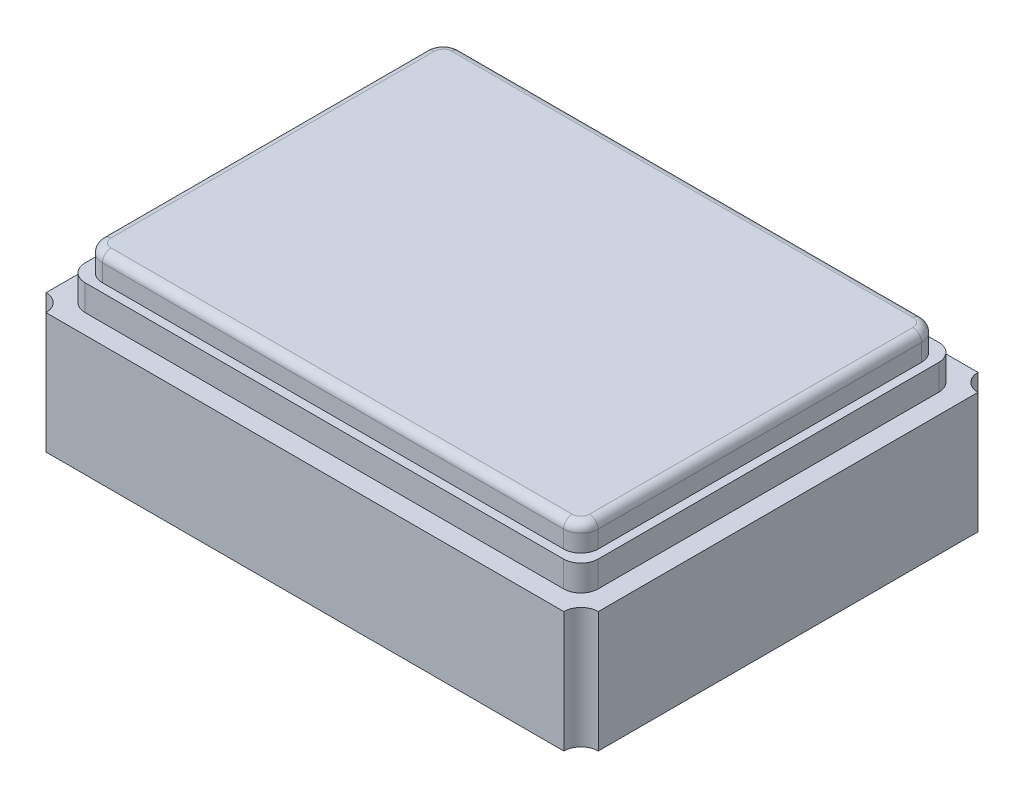
ISO-10303-21;
HEADER;
FILE_DESCRIPTION(('STEP AP214'),'2;1');
FILE_NAME('part.step','',(''),(''),'','','');
FILE_SCHEMA(('AUTOMOTIVE_DESIGN { 1 0 10303 214 1 1 1 1 }'));
ENDSEC;
DATA;
#1=APPLICATION_CONTEXT('core data for automotive mechanical design processes');
#2=APPLICATION_PROTOCOL_DEFINITION('international standard','automotive_design',2000,#1);
#3=PRODUCT_CONTEXT('',#1,'mechanical');
#4=PRODUCT('Part','Part','',(#3));
#5=PRODUCT_RELATED_PRODUCT_CATEGORY('part','',(#4));
#6=PRODUCT_DEFINITION_FORMATION('','',#4);
#7=PRODUCT_DEFINITION_CONTEXT('part definition',#1,'design');
#8=PRODUCT_DEFINITION('design','',#6,#7);
#9=PRODUCT_DEFINITION_SHAPE('','',#8);
#10=(LENGTH_UNIT() NAMED_UNIT(*) SI_UNIT(.MILLI.,.METRE.));
#11=(NAMED_UNIT(*) PLANE_ANGLE_UNIT() SI_UNIT($,.RADIAN.));
#12=(NAMED_UNIT(*) SI_UNIT($,.STERADIAN.) SOLID_ANGLE_UNIT());
#13=UNCERTAINTY_MEASURE_WITH_UNIT(LENGTH_MEASURE(1.E-05),#10,'distance_accuracy_value','');
#14=(GEOMETRIC_REPRESENTATION_CONTEXT(3) GLOBAL_UNCERTAINTY_ASSIGNED_CONTEXT((#13)) GLOBAL_UNIT_ASSIGNED_CONTEXT((#10,
#11,#12)) REPRESENTATION_CONTEXT('',''));
#15=CARTESIAN_POINT('',(0.,0.,0.));
#16=DIRECTION('',(0.,0.,1.));
#17=DIRECTION('',(1.,0.,0.));
#18=AXIS2_PLACEMENT_3D('',#15,#16,#17);
#19=CARTESIAN_POINT('',(-1.33609678096629,1.,0.936846899512658));
#20=DIRECTION('',(0.,-1.,0.));
#21=DIRECTION('',(0.,0.,-1.));
#22=AXIS2_PLACEMENT_3D('',#19,#20,#21);
#23=CYLINDRICAL_SURFACE('',#22,0.0999999999999999);
#24=DIRECTION('',(0.,-1.,0.));
#25=VECTOR('',#24,1.);
#26=CARTESIAN_POINT('',(-1.33609678096629,1.,1.03684689951266));
#27=LINE('',#26,#25);
#28=CARTESIAN_POINT('',(-1.33609678096629,0.95,1.03684689951266));
#29=VERTEX_POINT('',#28);
#30=CARTESIAN_POINT('',(-1.33609678096629,0.85,1.03684689951266));
#31=VERTEX_POINT('',#30);
#32=EDGE_CURVE('E131',#29,#31,#27,.T.);
#33=ORIENTED_EDGE('',*,*,#32,.F.);
#34=CARTESIAN_POINT('',(-1.33609678096629,0.95,0.936846899512658));
#35=DIRECTION('',(0.,-1.,0.));
#36=DIRECTION('',(0.,0.,-1.));
#37=AXIS2_PLACEMENT_3D('',#34,#35,#36);
#38=CIRCLE('',#37,0.0999999999999999);
#39=CARTESIAN_POINT('',(-1.43609678096628,0.95,0.936846899512658));
#40=VERTEX_POINT('',#39);
#41=EDGE_CURVE('E12',#29,#40,#38,.T.);
#42=ORIENTED_EDGE('',*,*,#41,.T.);
#43=DIRECTION('',(0.,-1.,0.));
#44=VECTOR('',#43,1.);
#45=CARTESIAN_POINT('',(-1.43609678096628,1.,0.936846899512658));
#46=LINE('',#45,#44);
#47=CARTESIAN_POINT('',(-1.43609678096628,0.85,0.936846899512658));
#48=VERTEX_POINT('',#47);
#49=EDGE_CURVE('E152',#40,#48,#46,.T.);
#50=ORIENTED_EDGE('',*,*,#49,.T.);
#51=CARTESIAN_POINT('',(-1.33609678096629,0.85,0.936846899512658));
#52=DIRECTION('',(0.,1.,0.));
#53=DIRECTION('',(0.,0.,-1.));
#54=AXIS2_PLACEMENT_3D('',#51,#52,#53);
#55=CIRCLE('',#54,0.0999999999999999);
#56=EDGE_CURVE('E146',#48,#31,#55,.T.);
#57=ORIENTED_EDGE('',*,*,#56,.T.);
#58=EDGE_LOOP('',(#33,#42,#50,#57));
#59=FACE_BOUND('',#58,.T.);
#60=ADVANCED_FACE('F43',(#59),#23,.T.);
#61=CARTESIAN_POINT('',(-1.33609678096629,1.,1.03684689951266));
#62=DIRECTION('',(0.,0.,-1.));
#63=DIRECTION('',(-1.,0.,0.));
#64=AXIS2_PLACEMENT_3D('',#61,#62,#63);
#65=PLANE('',#64);
#66=DIRECTION('',(0.,-1.,0.));
#67=VECTOR('',#66,1.);
#68=CARTESIAN_POINT('',(1.33609678096629,1.,1.03684689951266));
#69=LINE('',#68,#67);
#70=CARTESIAN_POINT('',(1.33609678096629,0.95,1.03684689951266));
#71=VERTEX_POINT('',#70);
#72=CARTESIAN_POINT('',(1.33609678096629,0.85,1.03684689951266));
#73=VERTEX_POINT('',#72);
#74=EDGE_CURVE('E140',#71,#73,#69,.T.);
#75=ORIENTED_EDGE('',*,*,#74,.F.);
#76=DIRECTION('',(1.,0.,0.));
#77=VECTOR('',#76,1.);
#78=CARTESIAN_POINT('',(-1.33609678096629,0.95,1.03684689951266));
#79=LINE('',#78,#77);
#80=EDGE_CURVE('E52',#71,#29,#79,.F.);
#81=ORIENTED_EDGE('',*,*,#80,.T.);
#82=ORIENTED_EDGE('',*,*,#32,.T.);
#83=DIRECTION('',(1.,0.,0.));
#84=VECTOR('',#83,1.);
#85=CARTESIAN_POINT('',(-1.33609678096629,0.85,1.03684689951266));
#86=LINE('',#85,#84);
#87=EDGE_CURVE('E134',#31,#73,#86,.T.);
#88=ORIENTED_EDGE('',*,*,#87,.T.);
#89=EDGE_LOOP('',(#75,#81,#82,#88));
#90=FACE_BOUND('',#89,.T.);
#91=ADVANCED_FACE('F133',(#90),#65,.F.);
#92=CARTESIAN_POINT('',(1.33609678096629,1.,0.936846899512658));
#93=DIRECTION('',(0.,-1.,0.));
#94=DIRECTION('',(0.,0.,-1.));
#95=AXIS2_PLACEMENT_3D('',#92,#93,#94);
#96=CYLINDRICAL_SURFACE('',#95,0.1);
#97=DIRECTION('',(0.,-1.,0.));
#98=VECTOR('',#97,1.);
#99=CARTESIAN_POINT('',(1.43609678096629,1.,0.936846899512658));
#100=LINE('',#99,#98);
#101=CARTESIAN_POINT('',(1.43609678096629,0.95,0.936846899512658));
#102=VERTEX_POINT('',#101);
#103=CARTESIAN_POINT('',(1.43609678096629,0.85,0.936846899512658));
#104=VERTEX_POINT('',#103);
#105=EDGE_CURVE('E182',#102,#104,#100,.T.);
#106=ORIENTED_EDGE('',*,*,#105,.F.);
#107=CARTESIAN_POINT('',(1.33609678096629,0.95,0.936846899512658));
#108=DIRECTION('',(0.,-1.,0.));
#109=DIRECTION('',(0.,0.,-1.));
#110=AXIS2_PLACEMENT_3D('',#107,#108,#109);
#111=CIRCLE('',#110,0.1);
#112=EDGE_CURVE('E67',#102,#71,#111,.T.);
#113=ORIENTED_EDGE('',*,*,#112,.T.);
#114=ORIENTED_EDGE('',*,*,#74,.T.);
#115=CARTESIAN_POINT('',(1.33609678096629,0.85,0.936846899512658));
#116=DIRECTION('',(0.,1.,0.));
#117=DIRECTION('',(0.,0.,1.));
#118=AXIS2_PLACEMENT_3D('',#115,#116,#117);
#119=CIRCLE('',#118,0.1);
#120=EDGE_CURVE('E149',#73,#104,#119,.T.);
#121=ORIENTED_EDGE('',*,*,#120,.T.);
#122=EDGE_LOOP('',(#106,#113,#114,#121));
#123=FACE_BOUND('',#122,.T.);
#124=ADVANCED_FACE('F285',(#123),#96,.T.);
#125=CARTESIAN_POINT('',(1.43609678096629,1.,0.936846899512658));
#126=DIRECTION('',(-1.,0.,0.));
#127=DIRECTION('',(0.,0.,1.));
#128=AXIS2_PLACEMENT_3D('',#125,#126,#127);
#129=PLANE('',#128);
#130=DIRECTION('',(0.,-1.,0.));
#131=VECTOR('',#130,1.);
#132=CARTESIAN_POINT('',(1.43609678096629,1.,-0.936846899512658));
#133=LINE('',#132,#131);
#134=CARTESIAN_POINT('',(1.43609678096629,0.95,-0.936846899512658));
#135=VERTEX_POINT('',#134);
#136=CARTESIAN_POINT('',(1.43609678096629,0.85,-0.936846899512658));
#137=VERTEX_POINT('',#136);
#138=EDGE_CURVE('E180',#135,#137,#133,.T.);
#139=ORIENTED_EDGE('',*,*,#138,.F.);
#140=DIRECTION('',(0.,0.,-1.));
#141=VECTOR('',#140,1.);
#142=CARTESIAN_POINT('',(1.43609678096629,0.95,0.936846899512658));
#143=LINE('',#142,#141);
#144=EDGE_CURVE('E210',#135,#102,#143,.F.);
#145=ORIENTED_EDGE('',*,*,#144,.T.);
#146=ORIENTED_EDGE('',*,*,#105,.T.);
#147=DIRECTION('',(0.,0.,-1.));
#148=VECTOR('',#147,1.);
#149=CARTESIAN_POINT('',(1.43609678096629,0.85,0.936846899512658));
#150=LINE('',#149,#148);
#151=EDGE_CURVE('E159',#104,#137,#150,.T.);
#152=ORIENTED_EDGE('',*,*,#151,.T.);
#153=EDGE_LOOP('',(#139,#145,#146,#152));
#154=FACE_BOUND('',#153,.T.);
#155=ADVANCED_FACE('F283',(#154),#129,.F.);
#156=CARTESIAN_POINT('',(1.33609678096629,1.,-0.936846899512658));
#157=DIRECTION('',(0.,-1.,0.));
#158=DIRECTION('',(0.,0.,-1.));
#159=AXIS2_PLACEMENT_3D('',#156,#157,#158);
#160=CYLINDRICAL_SURFACE('',#159,0.1);
#161=DIRECTION('',(0.,-1.,0.));
#162=VECTOR('',#161,1.);
#163=CARTESIAN_POINT('',(1.33609678096629,1.,-1.03684689951266));
#164=LINE('',#163,#162);
#165=CARTESIAN_POINT('',(1.33609678096629,0.95,-1.03684689951266));
#166=VERTEX_POINT('',#165);
#167=CARTESIAN_POINT('',(1.33609678096629,0.85,-1.03684689951266));
#168=VERTEX_POINT('',#167);
#169=EDGE_CURVE('E178',#166,#168,#164,.T.);
#170=ORIENTED_EDGE('',*,*,#169,.F.);
#171=CARTESIAN_POINT('',(1.33609678096629,0.95,-0.936846899512658));
#172=DIRECTION('',(0.,-1.,0.));
#173=DIRECTION('',(0.,0.,-1.));
#174=AXIS2_PLACEMENT_3D('',#171,#172,#173);
#175=CIRCLE('',#174,0.1);
#176=EDGE_CURVE('E208',#166,#135,#175,.T.);
#177=ORIENTED_EDGE('',*,*,#176,.T.);
#178=ORIENTED_EDGE('',*,*,#138,.T.);
#179=CARTESIAN_POINT('',(1.33609678096629,0.85,-0.936846899512658));
#180=DIRECTION('',(0.,1.,0.));
#181=DIRECTION('',(0.,0.,1.));
#182=AXIS2_PLACEMENT_3D('',#179,#180,#181);
#183=CIRCLE('',#182,0.1);
#184=EDGE_CURVE('E162',#137,#168,#183,.T.);
#185=ORIENTED_EDGE('',*,*,#184,.T.);
#186=EDGE_LOOP('',(#170,#177,#178,#185));
#187=FACE_BOUND('',#186,.T.);
#188=ADVANCED_FACE('F281',(#187),#160,.T.);
#189=CARTESIAN_POINT('',(1.33609678096629,1.,-1.03684689951266));
#190=DIRECTION('',(0.,0.,1.));
#191=DIRECTION('',(1.,0.,0.));
#192=AXIS2_PLACEMENT_3D('',#189,#190,#191);
#193=PLANE('',#192);
#194=DIRECTION('',(0.,-1.,0.));
#195=VECTOR('',#194,1.);
#196=CARTESIAN_POINT('',(-1.33609678096629,1.,-1.03684689951266));
#197=LINE('',#196,#195);
#198=CARTESIAN_POINT('',(-1.33609678096629,0.95,-1.03684689951266));
#199=VERTEX_POINT('',#198);
#200=CARTESIAN_POINT('',(-1.33609678096629,0.85,-1.03684689951266));
#201=VERTEX_POINT('',#200);
#202=EDGE_CURVE('E176',#199,#201,#197,.T.);
#203=ORIENTED_EDGE('',*,*,#202,.F.);
#204=DIRECTION('',(-1.,0.,0.));
#205=VECTOR('',#204,1.);
#206=CARTESIAN_POINT('',(1.33609678096629,0.95,-1.03684689951266));
#207=LINE('',#206,#205);
#208=EDGE_CURVE('E206',#199,#166,#207,.F.);
#209=ORIENTED_EDGE('',*,*,#208,.T.);
#210=ORIENTED_EDGE('',*,*,#169,.T.);
#211=DIRECTION('',(-1.,0.,0.));
#212=VECTOR('',#211,1.);
#213=CARTESIAN_POINT('',(1.33609678096629,0.85,-1.03684689951266));
#214=LINE('',#213,#212);
#215=EDGE_CURVE('E165',#168,#201,#214,.T.);
#216=ORIENTED_EDGE('',*,*,#215,.T.);
#217=EDGE_LOOP('',(#203,#209,#210,#216));
#218=FACE_BOUND('',#217,.T.);
#219=ADVANCED_FACE('F269',(#218),#193,.F.);
#220=CARTESIAN_POINT('',(-1.33609678096629,1.,-0.936846899512658));
#221=DIRECTION('',(0.,-1.,0.));
#222=DIRECTION('',(0.,0.,-1.));
#223=AXIS2_PLACEMENT_3D('',#220,#221,#222);
#224=CYLINDRICAL_SURFACE('',#223,0.1);
#225=DIRECTION('',(0.,-1.,0.));
#226=VECTOR('',#225,1.);
#227=CARTESIAN_POINT('',(-1.43609678096629,1.,-0.936846899512658));
#228=LINE('',#227,#226);
#229=CARTESIAN_POINT('',(-1.43609678096629,0.95,-0.936846899512658));
#230=VERTEX_POINT('',#229);
#231=CARTESIAN_POINT('',(-1.43609678096629,0.85,-0.936846899512658));
#232=VERTEX_POINT('',#231);
#233=EDGE_CURVE('E174',#230,#232,#228,.T.);
#234=ORIENTED_EDGE('',*,*,#233,.F.);
#235=CARTESIAN_POINT('',(-1.33609678096629,0.95,-0.936846899512658));
#236=DIRECTION('',(0.,-1.,0.));
#237=DIRECTION('',(0.,0.,-1.));
#238=AXIS2_PLACEMENT_3D('',#235,#236,#237);
#239=CIRCLE('',#238,0.1);
#240=EDGE_CURVE('E204',#230,#199,#239,.T.);
#241=ORIENTED_EDGE('',*,*,#240,.T.);
#242=ORIENTED_EDGE('',*,*,#202,.T.);
#243=CARTESIAN_POINT('',(-1.33609678096629,0.85,-0.936846899512658));
#244=DIRECTION('',(0.,1.,0.));
#245=DIRECTION('',(0.,0.,1.));
#246=AXIS2_PLACEMENT_3D('',#243,#244,#245);
#247=CIRCLE('',#246,0.1);
#248=EDGE_CURVE('E168',#201,#232,#247,.T.);
#249=ORIENTED_EDGE('',*,*,#248,.T.);
#250=EDGE_LOOP('',(#234,#241,#242,#249));
#251=FACE_BOUND('',#250,.T.);
#252=ADVANCED_FACE('F266',(#251),#224,.T.);
#253=CARTESIAN_POINT('',(-1.43609678096629,1.,-0.936846899512658));
#254=DIRECTION('',(1.,0.,0.));
#255=DIRECTION('',(0.,0.,-1.));
#256=AXIS2_PLACEMENT_3D('',#253,#254,#255);
#257=PLANE('',#256);
#258=ORIENTED_EDGE('',*,*,#49,.F.);
#259=DIRECTION('',(0.,0.,1.));
#260=VECTOR('',#259,1.);
#261=CARTESIAN_POINT('',(-1.43609678096629,0.95,-0.936846899512658));
#262=LINE('',#261,#260);
#263=EDGE_CURVE('E201',#40,#230,#262,.F.);
#264=ORIENTED_EDGE('',*,*,#263,.T.);
#265=ORIENTED_EDGE('',*,*,#233,.T.);
#266=DIRECTION('',(0.,0.,1.));
#267=VECTOR('',#266,1.);
#268=CARTESIAN_POINT('',(-1.43609678096629,0.85,-0.936846899512658));
#269=LINE('',#268,#267);
#270=EDGE_CURVE('E171',#232,#48,#269,.T.);
#271=ORIENTED_EDGE('',*,*,#270,.T.);
#272=EDGE_LOOP('',(#258,#264,#265,#271));
#273=FACE_BOUND('',#272,.T.);
#274=ADVANCED_FACE('F253',(#273),#257,.F.);
#275=CARTESIAN_POINT('',(-1.33609678096629,1.,0.936846899512658));
#276=DIRECTION('',(0.,-1.,0.));
#277=DIRECTION('',(0.,0.,-1.));
#278=AXIS2_PLACEMENT_3D('',#275,#276,#277);
#279=PLANE('',#278);
#280=CARTESIAN_POINT('',(-1.33609678096629,1.,-0.936846899512658));
#281=DIRECTION('',(0.,-1.,0.));
#282=DIRECTION('',(0.,0.,-1.));
#283=AXIS2_PLACEMENT_3D('',#280,#281,#282);
#284=CIRCLE('',#283,0.05);
#285=CARTESIAN_POINT('',(-1.33609678096629,1.,-0.986846899512658));
#286=VERTEX_POINT('',#285);
#287=CARTESIAN_POINT('',(-1.38609678096629,1.,-0.936846899512658));
#288=VERTEX_POINT('',#287);
#289=EDGE_CURVE('E196',#286,#288,#284,.F.);
#290=ORIENTED_EDGE('',*,*,#289,.T.);
#291=DIRECTION('',(0.,0.,1.));
#292=VECTOR('',#291,1.);
#293=CARTESIAN_POINT('',(-1.38609678096628,1.,0.936846899512658));
#294=LINE('',#293,#292);
#295=CARTESIAN_POINT('',(-1.38609678096628,1.,0.936846899512658));
#296=VERTEX_POINT('',#295);
#297=EDGE_CURVE('E198',#288,#296,#294,.T.);
#298=ORIENTED_EDGE('',*,*,#297,.T.);
#299=CARTESIAN_POINT('',(-1.33609678096629,1.,0.936846899512658));
#300=DIRECTION('',(0.,-1.,0.));
#301=DIRECTION('',(0.,0.,-1.));
#302=AXIS2_PLACEMENT_3D('',#299,#300,#301);
#303=CIRCLE('',#302,0.0499999999999999);
#304=CARTESIAN_POINT('',(-1.33609678096629,1.,0.986846899512658));
#305=VERTEX_POINT('',#304);
#306=EDGE_CURVE('E139',#296,#305,#303,.F.);
#307=ORIENTED_EDGE('',*,*,#306,.T.);
#308=DIRECTION('',(1.,0.,0.));
#309=VECTOR('',#308,1.);
#310=CARTESIAN_POINT('',(-1.33609678096629,1.,0.986846899512659));
#311=LINE('',#310,#309);
#312=CARTESIAN_POINT('',(1.33609678096629,1.,0.986846899512659));
#313=VERTEX_POINT('',#312);
#314=EDGE_CURVE('E186',#305,#313,#311,.T.);
#315=ORIENTED_EDGE('',*,*,#314,.T.);
#316=CARTESIAN_POINT('',(1.33609678096629,1.,0.936846899512658));
#317=DIRECTION('',(0.,-1.,0.));
#318=DIRECTION('',(0.,0.,-1.));
#319=AXIS2_PLACEMENT_3D('',#316,#317,#318);
#320=CIRCLE('',#319,0.05);
#321=CARTESIAN_POINT('',(1.38609678096629,1.,0.936846899512658));
#322=VERTEX_POINT('',#321);
#323=EDGE_CURVE('E188',#313,#322,#320,.F.);
#324=ORIENTED_EDGE('',*,*,#323,.T.);
#325=DIRECTION('',(0.,0.,-1.));
#326=VECTOR('',#325,1.);
#327=CARTESIAN_POINT('',(1.38609678096629,1.,0.936846899512658));
#328=LINE('',#327,#326);
#329=CARTESIAN_POINT('',(1.38609678096629,1.,-0.936846899512658));
#330=VERTEX_POINT('',#329);
#331=EDGE_CURVE('E190',#322,#330,#328,.T.);
#332=ORIENTED_EDGE('',*,*,#331,.T.);
#333=CARTESIAN_POINT('',(1.33609678096629,1.,-0.936846899512658));
#334=DIRECTION('',(0.,-1.,0.));
#335=DIRECTION('',(0.,0.,-1.));
#336=AXIS2_PLACEMENT_3D('',#333,#334,#335);
#337=CIRCLE('',#336,0.05);
#338=CARTESIAN_POINT('',(1.33609678096629,1.,-0.986846899512659));
#339=VERTEX_POINT('',#338);
#340=EDGE_CURVE('E192',#330,#339,#337,.F.);
#341=ORIENTED_EDGE('',*,*,#340,.T.);
#342=DIRECTION('',(-1.,0.,0.));
#343=VECTOR('',#342,1.);
#344=CARTESIAN_POINT('',(-1.33609678096629,1.,-0.986846899512658));
#345=LINE('',#344,#343);
#346=EDGE_CURVE('E194',#339,#286,#345,.T.);
#347=ORIENTED_EDGE('',*,*,#346,.T.);
#348=EDGE_LOOP('',(#290,#298,#307,#315,#324,#332,#341,#347));
#349=FACE_BOUND('',#348,.T.);
#350=ADVANCED_FACE('F241',(#349),#279,.F.);
#351=CARTESIAN_POINT('',(-1.33609678096629,0.85,0.936846899512658));
#352=DIRECTION('',(0.,-1.,0.));
#353=DIRECTION('',(0.,0.,-1.));
#354=AXIS2_PLACEMENT_3D('',#351,#352,#353);
#355=PLANE('',#354);
#356=ORIENTED_EDGE('',*,*,#56,.F.);
#357=ORIENTED_EDGE('',*,*,#270,.F.);
#358=ORIENTED_EDGE('',*,*,#248,.F.);
#359=ORIENTED_EDGE('',*,*,#215,.F.);
#360=ORIENTED_EDGE('',*,*,#184,.F.);
#361=ORIENTED_EDGE('',*,*,#151,.F.);
#362=ORIENTED_EDGE('',*,*,#120,.F.);
#363=ORIENTED_EDGE('',*,*,#87,.F.);
#364=EDGE_LOOP('',(#356,#357,#358,#359,#360,#361,#362,#363));
#365=FACE_BOUND('',#364,.T.);
#366=ADVANCED_FACE('F144',(#365),#355,.T.);
#367=CARTESIAN_POINT('',(1.38609678096629,0.95,0.936846899512658));
#368=DIRECTION('',(0.,0.,-1.));
#369=DIRECTION('',(-1.,0.,0.));
#370=AXIS2_PLACEMENT_3D('',#367,#368,#369);
#371=CYLINDRICAL_SURFACE('',#370,0.05);
#372=CARTESIAN_POINT('',(1.38609678096629,0.95,0.936846899512658));
#373=DIRECTION('',(0.,0.,1.));
#374=DIRECTION('',(1.,0.,0.));
#375=AXIS2_PLACEMENT_3D('',#372,#373,#374);
#376=CIRCLE('',#375,0.05);
#377=EDGE_CURVE('E156',#102,#322,#376,.T.);
#378=ORIENTED_EDGE('',*,*,#377,.F.);
#379=ORIENTED_EDGE('',*,*,#144,.F.);
#380=CARTESIAN_POINT('',(1.38609678096629,0.95,-0.936846899512658));
#381=DIRECTION('',(0.,0.,-1.));
#382=DIRECTION('',(-1.,0.,0.));
#383=AXIS2_PLACEMENT_3D('',#380,#381,#382);
#384=CIRCLE('',#383,0.05);
#385=EDGE_CURVE('E47',#330,#135,#384,.T.);
#386=ORIENTED_EDGE('',*,*,#385,.F.);
#387=ORIENTED_EDGE('',*,*,#331,.F.);
#388=EDGE_LOOP('',(#378,#379,#386,#387));
#389=FACE_BOUND('',#388,.T.);
#390=ADVANCED_FACE('F45',(#389),#371,.T.);
#391=CARTESIAN_POINT('',(1.33609678096629,0.95,-0.936846899512658));
#392=DIRECTION('',(0.,-1.,0.));
#393=DIRECTION('',(0.,0.,-1.));
#394=AXIS2_PLACEMENT_3D('',#391,#392,#393);
#395=TOROIDAL_SURFACE('',#394,0.05,0.05);
#396=ORIENTED_EDGE('',*,*,#385,.T.);
#397=ORIENTED_EDGE('',*,*,#176,.F.);
#398=CARTESIAN_POINT('',(1.33609678096629,0.95,-0.986846899512659));
#399=DIRECTION('',(-1.,0.,0.));
#400=DIRECTION('',(0.,0.,1.));
#401=AXIS2_PLACEMENT_3D('',#398,#399,#400);
#402=CIRCLE('',#401,0.05);
#403=EDGE_CURVE('E227',#339,#166,#402,.T.);
#404=ORIENTED_EDGE('',*,*,#403,.F.);
#405=ORIENTED_EDGE('',*,*,#340,.F.);
#406=EDGE_LOOP('',(#396,#397,#404,#405));
#407=FACE_BOUND('',#406,.T.);
#408=ADVANCED_FACE('F278',(#407),#395,.T.);
#409=CARTESIAN_POINT('',(1.33609678096629,0.95,0.936846899512658));
#410=DIRECTION('',(0.,-1.,0.));
#411=DIRECTION('',(0.,0.,-1.));
#412=AXIS2_PLACEMENT_3D('',#409,#410,#411);
#413=DEGENERATE_TOROIDAL_SURFACE('',#412,0.05,0.05,.T.);
#414=ORIENTED_EDGE('',*,*,#377,.T.);
#415=ORIENTED_EDGE('',*,*,#323,.F.);
#416=CARTESIAN_POINT('',(1.33609678096629,0.95,0.986846899512658));
#417=DIRECTION('',(-1.,0.,0.));
#418=DIRECTION('',(0.,0.,1.));
#419=AXIS2_PLACEMENT_3D('',#416,#417,#418);
#420=CIRCLE('',#419,0.05);
#421=EDGE_CURVE('E224',#71,#313,#420,.T.);
#422=ORIENTED_EDGE('',*,*,#421,.F.);
#423=ORIENTED_EDGE('',*,*,#112,.F.);
#424=EDGE_LOOP('',(#414,#415,#422,#423));
#425=FACE_BOUND('',#424,.T.);
#426=ADVANCED_FACE('F233',(#425),#413,.T.);
#427=CARTESIAN_POINT('',(-1.33609678096629,0.95,-0.986846899512658));
#428=DIRECTION('',(-1.,0.,0.));
#429=DIRECTION('',(0.,0.,1.));
#430=AXIS2_PLACEMENT_3D('',#427,#428,#429);
#431=CYLINDRICAL_SURFACE('',#430,0.05);
#432=ORIENTED_EDGE('',*,*,#403,.T.);
#433=ORIENTED_EDGE('',*,*,#208,.F.);
#434=CARTESIAN_POINT('',(-1.33609678096629,0.95,-0.986846899512658));
#435=DIRECTION('',(-1.,0.,0.));
#436=DIRECTION('',(0.,0.,1.));
#437=AXIS2_PLACEMENT_3D('',#434,#435,#436);
#438=CIRCLE('',#437,0.05);
#439=EDGE_CURVE('E221',#286,#199,#438,.T.);
#440=ORIENTED_EDGE('',*,*,#439,.F.);
#441=ORIENTED_EDGE('',*,*,#346,.F.);
#442=EDGE_LOOP('',(#432,#433,#440,#441));
#443=FACE_BOUND('',#442,.T.);
#444=ADVANCED_FACE('F274',(#443),#431,.T.);
#445=CARTESIAN_POINT('',(-1.33609678096629,0.95,0.986846899512659));
#446=DIRECTION('',(1.,0.,0.));
#447=DIRECTION('',(0.,0.,-1.));
#448=AXIS2_PLACEMENT_3D('',#445,#446,#447);
#449=CYLINDRICAL_SURFACE('',#448,0.05);
#450=ORIENTED_EDGE('',*,*,#421,.T.);
#451=ORIENTED_EDGE('',*,*,#314,.F.);
#452=CARTESIAN_POINT('',(-1.33609678096629,0.95,0.986846899512659));
#453=DIRECTION('',(-1.,0.,0.));
#454=DIRECTION('',(0.,0.,1.));
#455=AXIS2_PLACEMENT_3D('',#452,#453,#454);
#456=CIRCLE('',#455,0.05);
#457=EDGE_CURVE('E218',#29,#305,#456,.T.);
#458=ORIENTED_EDGE('',*,*,#457,.F.);
#459=ORIENTED_EDGE('',*,*,#80,.F.);
#460=EDGE_LOOP('',(#450,#451,#458,#459));
#461=FACE_BOUND('',#460,.T.);
#462=ADVANCED_FACE('F246',(#461),#449,.T.);
#463=CARTESIAN_POINT('',(-1.33609678096629,0.95,-0.936846899512658));
#464=DIRECTION('',(0.,-1.,0.));
#465=DIRECTION('',(0.,0.,-1.));
#466=AXIS2_PLACEMENT_3D('',#463,#464,#465);
#467=TOROIDAL_SURFACE('',#466,0.05,0.05);
#468=ORIENTED_EDGE('',*,*,#439,.T.);
#469=ORIENTED_EDGE('',*,*,#240,.F.);
#470=CARTESIAN_POINT('',(-1.38609678096629,0.95,-0.936846899512658));
#471=DIRECTION('',(0.,0.,1.));
#472=DIRECTION('',(1.,0.,0.));
#473=AXIS2_PLACEMENT_3D('',#470,#471,#472);
#474=CIRCLE('',#473,0.05);
#475=EDGE_CURVE('E216',#288,#230,#474,.T.);
#476=ORIENTED_EDGE('',*,*,#475,.F.);
#477=ORIENTED_EDGE('',*,*,#289,.F.);
#478=EDGE_LOOP('',(#468,#469,#476,#477));
#479=FACE_BOUND('',#478,.T.);
#480=ADVANCED_FACE('F262',(#479),#467,.T.);
#481=CARTESIAN_POINT('',(-1.33609678096629,0.95,0.936846899512658));
#482=DIRECTION('',(0.,-1.,0.));
#483=DIRECTION('',(0.,0.,-1.));
#484=AXIS2_PLACEMENT_3D('',#481,#482,#483);
#485=DEGENERATE_TOROIDAL_SURFACE('',#484,0.0499999999999999,0.05,.T.);
#486=ORIENTED_EDGE('',*,*,#457,.T.);
#487=ORIENTED_EDGE('',*,*,#306,.F.);
#488=CARTESIAN_POINT('',(-1.38609678096628,0.95,0.936846899512658));
#489=DIRECTION('',(0.,0.,-1.));
#490=DIRECTION('',(-1.,0.,0.));
#491=AXIS2_PLACEMENT_3D('',#488,#489,#490);
#492=CIRCLE('',#491,0.05);
#493=EDGE_CURVE('E214',#40,#296,#492,.T.);
#494=ORIENTED_EDGE('',*,*,#493,.F.);
#495=ORIENTED_EDGE('',*,*,#41,.F.);
#496=EDGE_LOOP('',(#486,#487,#494,#495));
#497=FACE_BOUND('',#496,.T.);
#498=ADVANCED_FACE('F249',(#497),#485,.T.);
#499=CARTESIAN_POINT('',(-1.38609678096628,0.95,0.936846899512658));
#500=DIRECTION('',(0.,0.,1.));
#501=DIRECTION('',(1.,0.,0.));
#502=AXIS2_PLACEMENT_3D('',#499,#500,#501);
#503=CYLINDRICAL_SURFACE('',#502,0.05);
#504=ORIENTED_EDGE('',*,*,#475,.T.);
#505=ORIENTED_EDGE('',*,*,#263,.F.);
#506=ORIENTED_EDGE('',*,*,#493,.T.);
#507=ORIENTED_EDGE('',*,*,#297,.F.);
#508=EDGE_LOOP('',(#504,#505,#506,#507));
#509=FACE_BOUND('',#508,.T.);
#510=ADVANCED_FACE('F256',(#509),#503,.T.);
#511=CLOSED_SHELL('',(#60,#91,#124,#155,#188,#219,#252,#274,#350,#366,#390,#408,#426,#444,#462,
#480,#498,#510));
#512=MANIFOLD_SOLID_BREP('B2',#511);
#513=CARTESIAN_POINT('',(-1.38609678096629,0.85,0.986846899512658));
#514=DIRECTION('',(0.,-1.,0.));
#515=DIRECTION('',(0.,0.,-1.));
#516=AXIS2_PLACEMENT_3D('',#513,#514,#515);
#517=CYLINDRICAL_SURFACE('',#516,0.1);
#518=CARTESIAN_POINT('',(-1.38609678096629,0.7,0.986846899512658));
#519=DIRECTION('',(0.,1.,0.));
#520=DIRECTION('',(0.,0.,-1.));
#521=AXIS2_PLACEMENT_3D('',#518,#519,#520);
#522=CIRCLE('',#521,0.1);
#523=CARTESIAN_POINT('',(-1.48609678096629,0.7,0.986846899512658));
#524=VERTEX_POINT('',#523);
#525=CARTESIAN_POINT('',(-1.38609678096628,0.7,1.08684689951266));
#526=VERTEX_POINT('',#525);
#527=EDGE_CURVE('E535',#524,#526,#522,.T.);
#528=ORIENTED_EDGE('',*,*,#527,.T.);
#529=DIRECTION('',(0.,-1.,0.));
#530=VECTOR('',#529,1.);
#531=CARTESIAN_POINT('',(-1.38609678096628,0.85,1.08684689951266));
#532=LINE('',#531,#530);
#533=CARTESIAN_POINT('',(-1.38609678096628,0.85,1.08684689951266));
#534=VERTEX_POINT('',#533);
#535=EDGE_CURVE('E41',#534,#526,#532,.T.);
#536=ORIENTED_EDGE('',*,*,#535,.F.);
#537=CARTESIAN_POINT('',(-1.38609678096629,0.85,0.986846899512658));
#538=DIRECTION('',(0.,1.,0.));
#539=DIRECTION('',(0.,0.,-1.));
#540=AXIS2_PLACEMENT_3D('',#537,#538,#539);
#541=CIRCLE('',#540,0.1);
#542=CARTESIAN_POINT('',(-1.48609678096629,0.85,0.986846899512658));
#543=VERTEX_POINT('',#542);
#544=EDGE_CURVE('E549',#543,#534,#541,.T.);
#545=ORIENTED_EDGE('',*,*,#544,.F.);
#546=DIRECTION('',(0.,-1.,0.));
#547=VECTOR('',#546,1.);
#548=CARTESIAN_POINT('',(-1.48609678096629,0.85,0.986846899512658));
#549=LINE('',#548,#547);
#550=EDGE_CURVE('E531',#543,#524,#549,.T.);
#551=ORIENTED_EDGE('',*,*,#550,.T.);
#552=EDGE_LOOP('',(#528,#536,#545,#551));
#553=FACE_BOUND('',#552,.T.);
#554=ADVANCED_FACE('F439',(#553),#517,.T.);
#555=CARTESIAN_POINT('',(-1.38609678096628,0.85,1.08684689951266));
#556=DIRECTION('',(0.,0.,-1.));
#557=DIRECTION('',(-1.,0.,0.));
#558=AXIS2_PLACEMENT_3D('',#555,#556,#557);
#559=PLANE('',#558);
#560=DIRECTION('',(1.,0.,0.));
#561=VECTOR('',#560,1.);
#562=CARTESIAN_POINT('',(-1.38609678096628,0.7,1.08684689951266));
#563=LINE('',#562,#561);
#564=CARTESIAN_POINT('',(1.38609678096628,0.7,1.08684689951266));
#565=VERTEX_POINT('',#564);
#566=EDGE_CURVE('E538',#526,#565,#563,.T.);
#567=ORIENTED_EDGE('',*,*,#566,.T.);
#568=DIRECTION('',(0.,-1.,0.));
#569=VECTOR('',#568,1.);
#570=CARTESIAN_POINT('',(1.38609678096628,0.85,1.08684689951266));
#571=LINE('',#570,#569);
#572=CARTESIAN_POINT('',(1.38609678096628,0.85,1.08684689951266));
#573=VERTEX_POINT('',#572);
#574=EDGE_CURVE('E447',#573,#565,#571,.T.);
#575=ORIENTED_EDGE('',*,*,#574,.F.);
#576=DIRECTION('',(1.,0.,0.));
#577=VECTOR('',#576,1.);
#578=CARTESIAN_POINT('',(-1.38609678096628,0.85,1.08684689951266));
#579=LINE('',#578,#577);
#580=EDGE_CURVE('E498',#534,#573,#579,.T.);
#581=ORIENTED_EDGE('',*,*,#580,.F.);
#582=ORIENTED_EDGE('',*,*,#535,.T.);
#583=EDGE_LOOP('',(#567,#575,#581,#582));
#584=FACE_BOUND('',#583,.T.);
#585=ADVANCED_FACE('F584',(#584),#559,.F.);
#586=CARTESIAN_POINT('',(1.38609678096629,0.85,0.986846899512658));
#587=DIRECTION('',(0.,-1.,0.));
#588=DIRECTION('',(0.,0.,-1.));
#589=AXIS2_PLACEMENT_3D('',#586,#587,#588);
#590=CYLINDRICAL_SURFACE('',#589,0.1);
#591=CARTESIAN_POINT('',(1.38609678096629,0.7,0.986846899512658));
#592=DIRECTION('',(0.,1.,0.));
#593=DIRECTION('',(0.,0.,1.));
#594=AXIS2_PLACEMENT_3D('',#591,#592,#593);
#595=CIRCLE('',#594,0.1);
#596=CARTESIAN_POINT('',(1.48609678096629,0.7,0.986846899512658));
#597=VERTEX_POINT('',#596);
#598=EDGE_CURVE('E540',#565,#597,#595,.T.);
#599=ORIENTED_EDGE('',*,*,#598,.T.);
#600=DIRECTION('',(0.,-1.,0.));
#601=VECTOR('',#600,1.);
#602=CARTESIAN_POINT('',(1.48609678096629,0.85,0.986846899512658));
#603=LINE('',#602,#601);
#604=CARTESIAN_POINT('',(1.48609678096629,0.85,0.986846899512658));
#605=VERTEX_POINT('',#604);
#606=EDGE_CURVE('E556',#605,#597,#603,.T.);
#607=ORIENTED_EDGE('',*,*,#606,.F.);
#608=CARTESIAN_POINT('',(1.38609678096629,0.85,0.986846899512658));
#609=DIRECTION('',(0.,1.,0.));
#610=DIRECTION('',(0.,0.,1.));
#611=AXIS2_PLACEMENT_3D('',#608,#609,#610);
#612=CIRCLE('',#611,0.1);
#613=EDGE_CURVE('E564',#573,#605,#612,.T.);
#614=ORIENTED_EDGE('',*,*,#613,.F.);
#615=ORIENTED_EDGE('',*,*,#574,.T.);
#616=EDGE_LOOP('',(#599,#607,#614,#615));
#617=FACE_BOUND('',#616,.T.);
#618=ADVANCED_FACE('F562',(#617),#590,.T.);
#619=CARTESIAN_POINT('',(1.48609678096629,0.85,0.986846899512658));
#620=DIRECTION('',(-1.,0.,0.));
#621=DIRECTION('',(0.,0.,1.));
#622=AXIS2_PLACEMENT_3D('',#619,#620,#621);
#623=PLANE('',#622);
#624=DIRECTION('',(0.,0.,-1.));
#625=VECTOR('',#624,1.);
#626=CARTESIAN_POINT('',(1.48609678096629,0.7,0.986846899512658));
#627=LINE('',#626,#625);
#628=CARTESIAN_POINT('',(1.48609678096629,0.7,-0.986846899512658));
#629=VERTEX_POINT('',#628);
#630=EDGE_CURVE('E542',#597,#629,#627,.T.);
#631=ORIENTED_EDGE('',*,*,#630,.T.);
#632=DIRECTION('',(0.,-1.,0.));
#633=VECTOR('',#632,1.);
#634=CARTESIAN_POINT('',(1.48609678096629,0.85,-0.986846899512658));
#635=LINE('',#634,#633);
#636=CARTESIAN_POINT('',(1.48609678096629,0.85,-0.986846899512658));
#637=VERTEX_POINT('',#636);
#638=EDGE_CURVE('E553',#637,#629,#635,.T.);
#639=ORIENTED_EDGE('',*,*,#638,.F.);
#640=DIRECTION('',(0.,0.,-1.));
#641=VECTOR('',#640,1.);
#642=CARTESIAN_POINT('',(1.48609678096629,0.85,0.986846899512658));
#643=LINE('',#642,#641);
#644=EDGE_CURVE('E576',#605,#637,#643,.T.);
#645=ORIENTED_EDGE('',*,*,#644,.F.);
#646=ORIENTED_EDGE('',*,*,#606,.T.);
#647=EDGE_LOOP('',(#631,#639,#645,#646));
#648=FACE_BOUND('',#647,.T.);
#649=ADVANCED_FACE('F572',(#648),#623,.F.);
#650=CARTESIAN_POINT('',(1.38609678096629,0.85,-0.986846899512658));
#651=DIRECTION('',(0.,-1.,0.));
#652=DIRECTION('',(0.,0.,-1.));
#653=AXIS2_PLACEMENT_3D('',#650,#651,#652);
#654=CYLINDRICAL_SURFACE('',#653,0.1);
#655=CARTESIAN_POINT('',(1.38609678096629,0.7,-0.986846899512658));
#656=DIRECTION('',(0.,1.,0.));
#657=DIRECTION('',(0.,0.,-1.));
#658=AXIS2_PLACEMENT_3D('',#655,#656,#657);
#659=CIRCLE('',#658,0.1);
#660=CARTESIAN_POINT('',(1.38609678096628,0.7,-1.08684689951266));
#661=VERTEX_POINT('',#660);
#662=EDGE_CURVE('E544',#629,#661,#659,.T.);
#663=ORIENTED_EDGE('',*,*,#662,.T.);
#664=DIRECTION('',(0.,-1.,0.));
#665=VECTOR('',#664,1.);
#666=CARTESIAN_POINT('',(1.38609678096628,0.85,-1.08684689951266));
#667=LINE('',#666,#665);
#668=CARTESIAN_POINT('',(1.38609678096628,0.85,-1.08684689951266));
#669=VERTEX_POINT('',#668);
#670=EDGE_CURVE('E526',#669,#661,#667,.T.);
#671=ORIENTED_EDGE('',*,*,#670,.F.);
#672=CARTESIAN_POINT('',(1.38609678096629,0.85,-0.986846899512658));
#673=DIRECTION('',(0.,1.,0.));
#674=DIRECTION('',(0.,0.,-1.));
#675=AXIS2_PLACEMENT_3D('',#672,#673,#674);
#676=CIRCLE('',#675,0.1);
#677=EDGE_CURVE('E517',#637,#669,#676,.T.);
#678=ORIENTED_EDGE('',*,*,#677,.F.);
#679=ORIENTED_EDGE('',*,*,#638,.T.);
#680=EDGE_LOOP('',(#663,#671,#678,#679));
#681=FACE_BOUND('',#680,.T.);
#682=ADVANCED_FACE('F575',(#681),#654,.T.);
#683=CARTESIAN_POINT('',(-1.38609678096628,0.85,-1.08684689951266));
#684=DIRECTION('',(0.,0.,1.));
#685=DIRECTION('',(1.,0.,0.));
#686=AXIS2_PLACEMENT_3D('',#683,#684,#685);
#687=PLANE('',#686);
#688=DIRECTION('',(-1.,0.,0.));
#689=VECTOR('',#688,1.);
#690=CARTESIAN_POINT('',(-1.38609678096628,0.7,-1.08684689951266));
#691=LINE('',#690,#689);
#692=CARTESIAN_POINT('',(-1.38609678096628,0.7,-1.08684689951266));
#693=VERTEX_POINT('',#692);
#694=EDGE_CURVE('E525',#661,#693,#691,.T.);
#695=ORIENTED_EDGE('',*,*,#694,.T.);
#696=DIRECTION('',(0.,-1.,0.));
#697=VECTOR('',#696,1.);
#698=CARTESIAN_POINT('',(-1.38609678096628,0.85,-1.08684689951266));
#699=LINE('',#698,#697);
#700=CARTESIAN_POINT('',(-1.38609678096628,0.85,-1.08684689951266));
#701=VERTEX_POINT('',#700);
#702=EDGE_CURVE('E522',#701,#693,#699,.T.);
#703=ORIENTED_EDGE('',*,*,#702,.F.);
#704=DIRECTION('',(-1.,0.,0.));
#705=VECTOR('',#704,1.);
#706=CARTESIAN_POINT('',(-1.38609678096628,0.85,-1.08684689951266));
#707=LINE('',#706,#705);
#708=EDGE_CURVE('E511',#669,#701,#707,.T.);
#709=ORIENTED_EDGE('',*,*,#708,.F.);
#710=ORIENTED_EDGE('',*,*,#670,.T.);
#711=EDGE_LOOP('',(#695,#703,#709,#710));
#712=FACE_BOUND('',#711,.T.);
#713=ADVANCED_FACE('F523',(#712),#687,.F.);
#714=CARTESIAN_POINT('',(-1.38609678096629,0.85,-0.986846899512658));
#715=DIRECTION('',(0.,-1.,0.));
#716=DIRECTION('',(0.,0.,-1.));
#717=AXIS2_PLACEMENT_3D('',#714,#715,#716);
#718=CYLINDRICAL_SURFACE('',#717,0.1);
#719=CARTESIAN_POINT('',(-1.38609678096629,0.7,-0.986846899512658));
#720=DIRECTION('',(0.,1.,0.));
#721=DIRECTION('',(0.,0.,-1.));
#722=AXIS2_PLACEMENT_3D('',#719,#720,#721);
#723=CIRCLE('',#722,0.1);
#724=CARTESIAN_POINT('',(-1.48609678096629,0.7,-0.986846899512658));
#725=VERTEX_POINT('',#724);
#726=EDGE_CURVE('E484',#693,#725,#723,.T.);
#727=ORIENTED_EDGE('',*,*,#726,.T.);
#728=DIRECTION('',(0.,-1.,0.));
#729=VECTOR('',#728,1.);
#730=CARTESIAN_POINT('',(-1.48609678096629,0.85,-0.986846899512658));
#731=LINE('',#730,#729);
#732=CARTESIAN_POINT('',(-1.48609678096629,0.85,-0.986846899512658));
#733=VERTEX_POINT('',#732);
#734=EDGE_CURVE('E527',#733,#725,#731,.T.);
#735=ORIENTED_EDGE('',*,*,#734,.F.);
#736=CARTESIAN_POINT('',(-1.38609678096629,0.85,-0.986846899512658));
#737=DIRECTION('',(0.,1.,0.));
#738=DIRECTION('',(0.,0.,-1.));
#739=AXIS2_PLACEMENT_3D('',#736,#737,#738);
#740=CIRCLE('',#739,0.1);
#741=EDGE_CURVE('E515',#701,#733,#740,.T.);
#742=ORIENTED_EDGE('',*,*,#741,.F.);
#743=ORIENTED_EDGE('',*,*,#702,.T.);
#744=EDGE_LOOP('',(#727,#735,#742,#743));
#745=FACE_BOUND('',#744,.T.);
#746=ADVANCED_FACE('F529',(#745),#718,.T.);
#747=CARTESIAN_POINT('',(-1.48609678096629,0.85,0.986846899512658));
#748=DIRECTION('',(1.,0.,0.));
#749=DIRECTION('',(0.,0.,-1.));
#750=AXIS2_PLACEMENT_3D('',#747,#748,#749);
#751=PLANE('',#750);
#752=DIRECTION('',(0.,0.,1.));
#753=VECTOR('',#752,1.);
#754=CARTESIAN_POINT('',(-1.48609678096629,0.7,0.986846899512658));
#755=LINE('',#754,#753);
#756=EDGE_CURVE('E490',#725,#524,#755,.T.);
#757=ORIENTED_EDGE('',*,*,#756,.T.);
#758=ORIENTED_EDGE('',*,*,#550,.F.);
#759=DIRECTION('',(0.,0.,1.));
#760=VECTOR('',#759,1.);
#761=CARTESIAN_POINT('',(-1.48609678096629,0.85,0.986846899512658));
#762=LINE('',#761,#760);
#763=EDGE_CURVE('E455',#733,#543,#762,.T.);
#764=ORIENTED_EDGE('',*,*,#763,.F.);
#765=ORIENTED_EDGE('',*,*,#734,.T.);
#766=EDGE_LOOP('',(#757,#758,#764,#765));
#767=FACE_BOUND('',#766,.T.);
#768=ADVANCED_FACE('F600',(#767),#751,.F.);
#769=CARTESIAN_POINT('',(-1.38609678096629,0.85,0.986846899512658));
#770=DIRECTION('',(0.,-1.,0.));
#771=DIRECTION('',(0.,0.,-1.));
#772=AXIS2_PLACEMENT_3D('',#769,#770,#771);
#773=PLANE('',#772);
#774=ORIENTED_EDGE('',*,*,#544,.T.);
#775=ORIENTED_EDGE('',*,*,#580,.T.);
#776=ORIENTED_EDGE('',*,*,#613,.T.);
#777=ORIENTED_EDGE('',*,*,#644,.T.);
#778=ORIENTED_EDGE('',*,*,#677,.T.);
#779=ORIENTED_EDGE('',*,*,#708,.T.);
#780=ORIENTED_EDGE('',*,*,#741,.T.);
#781=ORIENTED_EDGE('',*,*,#763,.T.);
#782=EDGE_LOOP('',(#774,#775,#776,#777,#778,#779,#780,#781));
#783=FACE_BOUND('',#782,.T.);
#784=ADVANCED_FACE('F513',(#783),#773,.F.);
#785=CARTESIAN_POINT('',(-1.38609678096629,0.7,0.986846899512658));
#786=DIRECTION('',(0.,-1.,0.));
#787=DIRECTION('',(0.,0.,-1.));
#788=AXIS2_PLACEMENT_3D('',#785,#786,#787);
#789=PLANE('',#788);
#790=ORIENTED_EDGE('',*,*,#527,.F.);
#791=ORIENTED_EDGE('',*,*,#756,.F.);
#792=ORIENTED_EDGE('',*,*,#726,.F.);
#793=ORIENTED_EDGE('',*,*,#694,.F.);
#794=ORIENTED_EDGE('',*,*,#662,.F.);
#795=ORIENTED_EDGE('',*,*,#630,.F.);
#796=ORIENTED_EDGE('',*,*,#598,.F.);
#797=ORIENTED_EDGE('',*,*,#566,.F.);
#798=EDGE_LOOP('',(#790,#791,#792,#793,#794,#795,#796,#797));
#799=FACE_BOUND('',#798,.T.);
#800=ADVANCED_FACE('F568',(#799),#789,.T.);
#801=CLOSED_SHELL('',(#554,#585,#618,#649,#682,#713,#746,#768,#784,#800));
#802=MANIFOLD_SOLID_BREP('B6',#801);
#803=CARTESIAN_POINT('',(1.6,0.7,1.2));
#804=DIRECTION('',(-1.,0.,0.));
#805=DIRECTION('',(0.,0.,1.));
#806=AXIS2_PLACEMENT_3D('',#803,#804,#805);
#807=PLANE('',#806);
#808=DIRECTION('',(0.,0.,-1.));
#809=VECTOR('',#808,1.);
#810=CARTESIAN_POINT('',(1.6,0.7,1.2));
#811=LINE('',#810,#809);
#812=CARTESIAN_POINT('',(1.6,0.7,1.1));
#813=VERTEX_POINT('',#812);
#814=CARTESIAN_POINT('',(1.6,0.7,-1.1));
#815=VERTEX_POINT('',#814);
#816=EDGE_CURVE('E744',#813,#815,#811,.T.);
#817=ORIENTED_EDGE('',*,*,#816,.F.);
#818=DIRECTION('',(0.,1.,0.));
#819=VECTOR('',#818,1.);
#820=CARTESIAN_POINT('',(1.6,0.,1.1));
#821=LINE('',#820,#819);
#822=CARTESIAN_POINT('',(1.6,0.,1.1));
#823=VERTEX_POINT('',#822);
#824=EDGE_CURVE('E780',#813,#823,#821,.F.);
#825=ORIENTED_EDGE('',*,*,#824,.T.);
#826=DIRECTION('',(0.,0.,-1.));
#827=VECTOR('',#826,1.);
#828=CARTESIAN_POINT('',(1.6,0.,1.2));
#829=LINE('',#828,#827);
#830=CARTESIAN_POINT('',(1.6,0.,-1.1));
#831=VERTEX_POINT('',#830);
#832=EDGE_CURVE('E752',#823,#831,#829,.T.);
#833=ORIENTED_EDGE('',*,*,#832,.T.);
#834=DIRECTION('',(0.,1.,0.));
#835=VECTOR('',#834,1.);
#836=CARTESIAN_POINT('',(1.6,0.,-1.1));
#837=LINE('',#836,#835);
#838=EDGE_CURVE('E769',#831,#815,#837,.T.);
#839=ORIENTED_EDGE('',*,*,#838,.T.);
#840=EDGE_LOOP('',(#817,#825,#833,#839));
#841=FACE_BOUND('',#840,.T.);
#842=ADVANCED_FACE('F666',(#841),#807,.F.);
#843=CARTESIAN_POINT('',(-1.6,0.7,-1.2));
#844=DIRECTION('',(0.,0.,1.));
#845=DIRECTION('',(1.,0.,0.));
#846=AXIS2_PLACEMENT_3D('',#843,#844,#845);
#847=PLANE('',#846);
#848=DIRECTION('',(-1.,0.,0.));
#849=VECTOR('',#848,1.);
#850=CARTESIAN_POINT('',(-1.6,0.7,-1.2));
#851=LINE('',#850,#849);
#852=CARTESIAN_POINT('',(1.5,0.7,-1.2));
#853=VERTEX_POINT('',#852);
#854=CARTESIAN_POINT('',(-1.5,0.7,-1.2));
#855=VERTEX_POINT('',#854);
#856=EDGE_CURVE('E746',#853,#855,#851,.T.);
#857=ORIENTED_EDGE('',*,*,#856,.F.);
#858=DIRECTION('',(0.,1.,0.));
#859=VECTOR('',#858,1.);
#860=CARTESIAN_POINT('',(1.5,0.,-1.2));
#861=LINE('',#860,#859);
#862=CARTESIAN_POINT('',(1.5,0.,-1.2));
#863=VERTEX_POINT('',#862);
#864=EDGE_CURVE('E774',#853,#863,#861,.F.);
#865=ORIENTED_EDGE('',*,*,#864,.T.);
#866=DIRECTION('',(-1.,0.,0.));
#867=VECTOR('',#866,1.);
#868=CARTESIAN_POINT('',(-1.6,0.,-1.2));
#869=LINE('',#868,#867);
#870=CARTESIAN_POINT('',(-1.5,0.,-1.2));
#871=VERTEX_POINT('',#870);
#872=EDGE_CURVE('E748',#863,#871,#869,.T.);
#873=ORIENTED_EDGE('',*,*,#872,.T.);
#874=DIRECTION('',(0.,1.,0.));
#875=VECTOR('',#874,1.);
#876=CARTESIAN_POINT('',(-1.5,0.,-1.2));
#877=LINE('',#876,#875);
#878=EDGE_CURVE('E754',#871,#855,#877,.T.);
#879=ORIENTED_EDGE('',*,*,#878,.T.);
#880=EDGE_LOOP('',(#857,#865,#873,#879));
#881=FACE_BOUND('',#880,.T.);
#882=ADVANCED_FACE('F802',(#881),#847,.F.);
#883=CARTESIAN_POINT('',(-1.6,0.7,1.2));
#884=DIRECTION('',(1.,0.,0.));
#885=DIRECTION('',(0.,0.,-1.));
#886=AXIS2_PLACEMENT_3D('',#883,#884,#885);
#887=PLANE('',#886);
#888=DIRECTION('',(0.,0.,1.));
#889=VECTOR('',#888,1.);
#890=CARTESIAN_POINT('',(-1.6,0.,1.2));
#891=LINE('',#890,#889);
#892=CARTESIAN_POINT('',(-1.6,0.,-1.1));
#893=VERTEX_POINT('',#892);
#894=CARTESIAN_POINT('',(-1.6,0.,1.1));
#895=VERTEX_POINT('',#894);
#896=EDGE_CURVE('E745',#893,#895,#891,.T.);
#897=ORIENTED_EDGE('',*,*,#896,.T.);
#898=DIRECTION('',(0.,1.,0.));
#899=VECTOR('',#898,1.);
#900=CARTESIAN_POINT('',(-1.6,0.,1.1));
#901=LINE('',#900,#899);
#902=CARTESIAN_POINT('',(-1.6,0.7,1.1));
#903=VERTEX_POINT('',#902);
#904=EDGE_CURVE('E680',#895,#903,#901,.T.);
#905=ORIENTED_EDGE('',*,*,#904,.T.);
#906=DIRECTION('',(0.,0.,1.));
#907=VECTOR('',#906,1.);
#908=CARTESIAN_POINT('',(-1.6,0.7,1.2));
#909=LINE('',#908,#907);
#910=CARTESIAN_POINT('',(-1.6,0.7,-1.1));
#911=VERTEX_POINT('',#910);
#912=EDGE_CURVE('E756',#911,#903,#909,.T.);
#913=ORIENTED_EDGE('',*,*,#912,.F.);
#914=DIRECTION('',(0.,1.,0.));
#915=VECTOR('',#914,1.);
#916=CARTESIAN_POINT('',(-1.6,0.,-1.1));
#917=LINE('',#916,#915);
#918=EDGE_CURVE('E762',#911,#893,#917,.F.);
#919=ORIENTED_EDGE('',*,*,#918,.T.);
#920=EDGE_LOOP('',(#897,#905,#913,#919));
#921=FACE_BOUND('',#920,.T.);
#922=ADVANCED_FACE('F793',(#921),#887,.F.);
#923=CARTESIAN_POINT('',(-1.6,0.7,1.2));
#924=DIRECTION('',(0.,0.,-1.));
#925=DIRECTION('',(-1.,0.,0.));
#926=AXIS2_PLACEMENT_3D('',#923,#924,#925);
#927=PLANE('',#926);
#928=DIRECTION('',(1.,0.,0.));
#929=VECTOR('',#928,1.);
#930=CARTESIAN_POINT('',(-1.6,0.7,1.2));
#931=LINE('',#930,#929);
#932=CARTESIAN_POINT('',(-1.5,0.7,1.2));
#933=VERTEX_POINT('',#932);
#934=CARTESIAN_POINT('',(1.5,0.7,1.2));
#935=VERTEX_POINT('',#934);
#936=EDGE_CURVE('E673',#933,#935,#931,.T.);
#937=ORIENTED_EDGE('',*,*,#936,.F.);
#938=DIRECTION('',(0.,1.,0.));
#939=VECTOR('',#938,1.);
#940=CARTESIAN_POINT('',(-1.5,0.,1.2));
#941=LINE('',#940,#939);
#942=CARTESIAN_POINT('',(-1.5,0.,1.2));
#943=VERTEX_POINT('',#942);
#944=EDGE_CURVE('E730',#933,#943,#941,.F.);
#945=ORIENTED_EDGE('',*,*,#944,.T.);
#946=DIRECTION('',(1.,0.,0.));
#947=VECTOR('',#946,1.);
#948=CARTESIAN_POINT('',(-1.6,0.,1.2));
#949=LINE('',#948,#947);
#950=CARTESIAN_POINT('',(1.5,0.,1.2));
#951=VERTEX_POINT('',#950);
#952=EDGE_CURVE('E688',#943,#951,#949,.T.);
#953=ORIENTED_EDGE('',*,*,#952,.T.);
#954=DIRECTION('',(0.,1.,0.));
#955=VECTOR('',#954,1.);
#956=CARTESIAN_POINT('',(1.5,0.,1.2));
#957=LINE('',#956,#955);
#958=EDGE_CURVE('E783',#951,#935,#957,.T.);
#959=ORIENTED_EDGE('',*,*,#958,.T.);
#960=EDGE_LOOP('',(#937,#945,#953,#959));
#961=FACE_BOUND('',#960,.T.);
#962=ADVANCED_FACE('F738',(#961),#927,.F.);
#963=CARTESIAN_POINT('',(0.,0.7,0.));
#964=DIRECTION('',(0.,-1.,0.));
#965=DIRECTION('',(0.,0.,-1.));
#966=AXIS2_PLACEMENT_3D('',#963,#964,#965);
#967=PLANE('',#966);
#968=ORIENTED_EDGE('',*,*,#912,.T.);
#969=CARTESIAN_POINT('',(-1.6,0.7,1.2));
#970=DIRECTION('',(0.,1.,0.));
#971=DIRECTION('',(0.,0.,1.));
#972=AXIS2_PLACEMENT_3D('',#969,#970,#971);
#973=CIRCLE('',#972,0.1);
#974=EDGE_CURVE('E735',#933,#903,#973,.T.);
#975=ORIENTED_EDGE('',*,*,#974,.F.);
#976=ORIENTED_EDGE('',*,*,#936,.T.);
#977=CARTESIAN_POINT('',(1.6,0.7,1.2));
#978=DIRECTION('',(0.,1.,0.));
#979=DIRECTION('',(0.,0.,1.));
#980=AXIS2_PLACEMENT_3D('',#977,#978,#979);
#981=CIRCLE('',#980,0.1);
#982=EDGE_CURVE('E785',#813,#935,#981,.T.);
#983=ORIENTED_EDGE('',*,*,#982,.F.);
#984=ORIENTED_EDGE('',*,*,#816,.T.);
#985=CARTESIAN_POINT('',(1.6,0.7,-1.2));
#986=DIRECTION('',(0.,1.,0.));
#987=DIRECTION('',(0.,0.,1.));
#988=AXIS2_PLACEMENT_3D('',#985,#986,#987);
#989=CIRCLE('',#988,0.1);
#990=EDGE_CURVE('E777',#853,#815,#989,.T.);
#991=ORIENTED_EDGE('',*,*,#990,.F.);
#992=ORIENTED_EDGE('',*,*,#856,.T.);
#993=CARTESIAN_POINT('',(-1.6,0.7,-1.2));
#994=DIRECTION('',(0.,1.,0.));
#995=DIRECTION('',(0.,0.,1.));
#996=AXIS2_PLACEMENT_3D('',#993,#994,#995);
#997=CIRCLE('',#996,0.1);
#998=EDGE_CURVE('E766',#911,#855,#997,.T.);
#999=ORIENTED_EDGE('',*,*,#998,.F.);
#1000=EDGE_LOOP('',(#968,#975,#976,#983,#984,#991,#992,#999));
#1001=FACE_BOUND('',#1000,.T.);
#1002=ADVANCED_FACE('F795',(#1001),#967,.F.);
#1003=CARTESIAN_POINT('',(0.,0.,0.));
#1004=DIRECTION('',(0.,-1.,0.));
#1005=DIRECTION('',(0.,0.,-1.));
#1006=AXIS2_PLACEMENT_3D('',#1003,#1004,#1005);
#1007=PLANE('',#1006);
#1008=CARTESIAN_POINT('',(-1.6,0.,1.2));
#1009=DIRECTION('',(0.,1.,0.));
#1010=DIRECTION('',(0.,0.,1.));
#1011=AXIS2_PLACEMENT_3D('',#1008,#1009,#1010);
#1012=CIRCLE('',#1011,0.1);
#1013=EDGE_CURVE('E728',#943,#895,#1012,.T.);
#1014=ORIENTED_EDGE('',*,*,#1013,.T.);
#1015=ORIENTED_EDGE('',*,*,#896,.F.);
#1016=CARTESIAN_POINT('',(-1.6,0.,-1.2));
#1017=DIRECTION('',(0.,1.,0.));
#1018=DIRECTION('',(0.,0.,1.));
#1019=AXIS2_PLACEMENT_3D('',#1016,#1017,#1018);
#1020=CIRCLE('',#1019,0.1);
#1021=EDGE_CURVE('E765',#893,#871,#1020,.T.);
#1022=ORIENTED_EDGE('',*,*,#1021,.T.);
#1023=ORIENTED_EDGE('',*,*,#872,.F.);
#1024=CARTESIAN_POINT('',(1.6,0.,-1.2));
#1025=DIRECTION('',(0.,-1.,0.));
#1026=DIRECTION('',(0.,0.,-1.));
#1027=AXIS2_PLACEMENT_3D('',#1024,#1025,#1026);
#1028=CIRCLE('',#1027,0.1);
#1029=EDGE_CURVE('E437',#831,#863,#1028,.T.);
#1030=ORIENTED_EDGE('',*,*,#1029,.F.);
#1031=ORIENTED_EDGE('',*,*,#832,.F.);
#1032=CARTESIAN_POINT('',(1.6,0.,1.2));
#1033=DIRECTION('',(0.,1.,0.));
#1034=DIRECTION('',(0.,0.,1.));
#1035=AXIS2_PLACEMENT_3D('',#1032,#1033,#1034);
#1036=CIRCLE('',#1035,0.1);
#1037=EDGE_CURVE('E743',#823,#951,#1036,.T.);
#1038=ORIENTED_EDGE('',*,*,#1037,.T.);
#1039=ORIENTED_EDGE('',*,*,#952,.F.);
#1040=EDGE_LOOP('',(#1014,#1015,#1022,#1023,#1030,#1031,#1038,#1039));
#1041=FACE_BOUND('',#1040,.T.);
#1042=ADVANCED_FACE('F741',(#1041),#1007,.T.);
#1043=CARTESIAN_POINT('',(-1.6,0.,-1.2));
#1044=DIRECTION('',(0.,1.,0.));
#1045=DIRECTION('',(0.,0.,1.));
#1046=AXIS2_PLACEMENT_3D('',#1043,#1044,#1045);
#1047=CYLINDRICAL_SURFACE('',#1046,0.1);
#1048=ORIENTED_EDGE('',*,*,#1021,.F.);
#1049=ORIENTED_EDGE('',*,*,#918,.F.);
#1050=ORIENTED_EDGE('',*,*,#998,.T.);
#1051=ORIENTED_EDGE('',*,*,#878,.F.);
#1052=EDGE_LOOP('',(#1048,#1049,#1050,#1051));
#1053=FACE_BOUND('',#1052,.T.);
#1054=ADVANCED_FACE('F800',(#1053),#1047,.F.);
#1055=CARTESIAN_POINT('',(1.6,0.,-1.2));
#1056=DIRECTION('',(0.,1.,0.));
#1057=DIRECTION('',(0.,0.,1.));
#1058=AXIS2_PLACEMENT_3D('',#1055,#1056,#1057);
#1059=CYLINDRICAL_SURFACE('',#1058,0.1);
#1060=ORIENTED_EDGE('',*,*,#1029,.T.);
#1061=ORIENTED_EDGE('',*,*,#864,.F.);
#1062=ORIENTED_EDGE('',*,*,#990,.T.);
#1063=ORIENTED_EDGE('',*,*,#838,.F.);
#1064=EDGE_LOOP('',(#1060,#1061,#1062,#1063));
#1065=FACE_BOUND('',#1064,.T.);
#1066=ADVANCED_FACE('F807',(#1065),#1059,.F.);
#1067=CARTESIAN_POINT('',(1.6,0.,1.2));
#1068=DIRECTION('',(0.,1.,0.));
#1069=DIRECTION('',(0.,0.,1.));
#1070=AXIS2_PLACEMENT_3D('',#1067,#1068,#1069);
#1071=CYLINDRICAL_SURFACE('',#1070,0.1);
#1072=ORIENTED_EDGE('',*,*,#982,.T.);
#1073=ORIENTED_EDGE('',*,*,#958,.F.);
#1074=ORIENTED_EDGE('',*,*,#1037,.F.);
#1075=ORIENTED_EDGE('',*,*,#824,.F.);
#1076=EDGE_LOOP('',(#1072,#1073,#1074,#1075));
#1077=FACE_BOUND('',#1076,.T.);
#1078=ADVANCED_FACE('F812',(#1077),#1071,.F.);
#1079=CARTESIAN_POINT('',(-1.6,0.,1.2));
#1080=DIRECTION('',(0.,1.,0.));
#1081=DIRECTION('',(0.,0.,1.));
#1082=AXIS2_PLACEMENT_3D('',#1079,#1080,#1081);
#1083=CYLINDRICAL_SURFACE('',#1082,0.1);
#1084=ORIENTED_EDGE('',*,*,#1013,.F.);
#1085=ORIENTED_EDGE('',*,*,#944,.F.);
#1086=ORIENTED_EDGE('',*,*,#974,.T.);
#1087=ORIENTED_EDGE('',*,*,#904,.F.);
#1088=EDGE_LOOP('',(#1084,#1085,#1086,#1087));
#1089=FACE_BOUND('',#1088,.T.);
#1090=ADVANCED_FACE('F729',(#1089),#1083,.F.);
#1091=CLOSED_SHELL('',(#842,#882,#922,#962,#1002,#1042,#1054,#1066,#1078,#1090));
#1092=MANIFOLD_SOLID_BREP('B35',#1091);
#1093=ADVANCED_BREP_SHAPE_REPRESENTATION('',(#18,#512,#802,#1092),#14);
#1094=SHAPE_DEFINITION_REPRESENTATION(#9,#1093);
ENDSEC;
END-ISO-10303-21;
